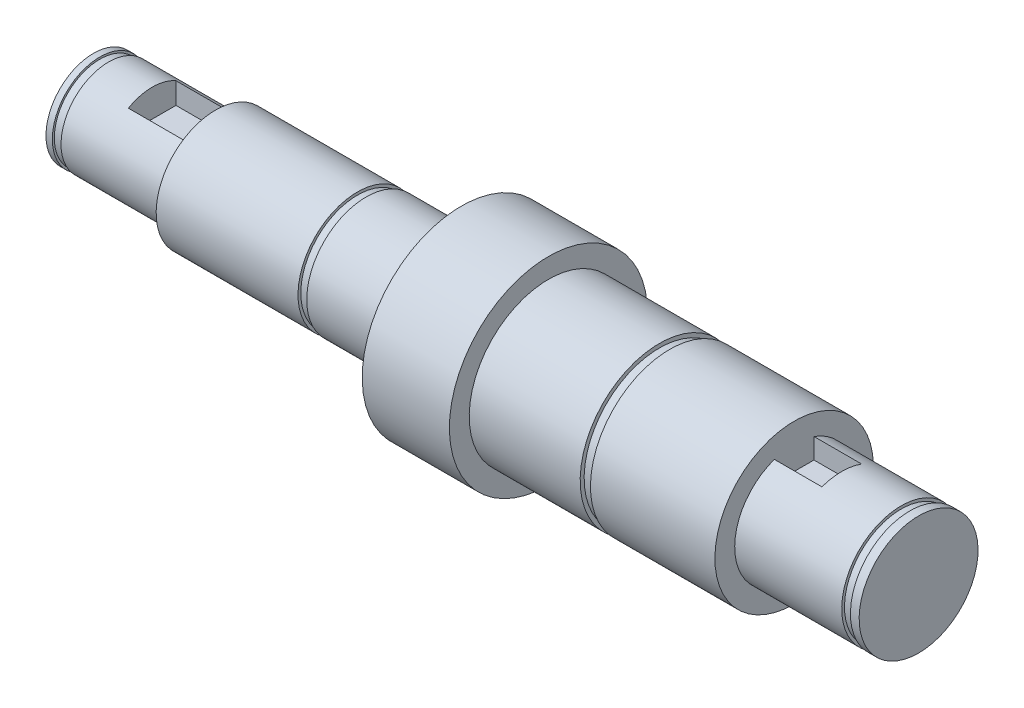
ISO-10303-21;
HEADER;
FILE_DESCRIPTION(('STEP AP214'),'2;1');
FILE_NAME('part.step','',(''),(''),'','','');
FILE_SCHEMA(('AUTOMOTIVE_DESIGN { 1 0 10303 214 1 1 1 1 }'));
ENDSEC;
DATA;
#1=APPLICATION_CONTEXT('core data for automotive mechanical design processes');
#2=APPLICATION_PROTOCOL_DEFINITION('international standard','automotive_design',2000,#1);
#3=PRODUCT_CONTEXT('',#1,'mechanical');
#4=PRODUCT('Part','Part','',(#3));
#5=PRODUCT_RELATED_PRODUCT_CATEGORY('part','',(#4));
#6=PRODUCT_DEFINITION_FORMATION('','',#4);
#7=PRODUCT_DEFINITION_CONTEXT('part definition',#1,'design');
#8=PRODUCT_DEFINITION('design','',#6,#7);
#9=PRODUCT_DEFINITION_SHAPE('','',#8);
#10=(LENGTH_UNIT() NAMED_UNIT(*) SI_UNIT(.MILLI.,.METRE.));
#11=(NAMED_UNIT(*) PLANE_ANGLE_UNIT() SI_UNIT($,.RADIAN.));
#12=(NAMED_UNIT(*) SI_UNIT($,.STERADIAN.) SOLID_ANGLE_UNIT());
#13=UNCERTAINTY_MEASURE_WITH_UNIT(LENGTH_MEASURE(1.E-05),#10,'distance_accuracy_value','');
#14=(GEOMETRIC_REPRESENTATION_CONTEXT(3) GLOBAL_UNCERTAINTY_ASSIGNED_CONTEXT((#13)) GLOBAL_UNIT_ASSIGNED_CONTEXT((#10,
#11,#12)) REPRESENTATION_CONTEXT('',''));
#15=CARTESIAN_POINT('',(0.,0.,0.));
#16=DIRECTION('',(0.,0.,1.));
#17=DIRECTION('',(1.,0.,0.));
#18=AXIS2_PLACEMENT_3D('',#15,#16,#17);
#19=CARTESIAN_POINT('',(-52.05,0.,0.));
#20=DIRECTION('',(-1.,0.,0.));
#21=DIRECTION('',(0.,-1.,0.));
#22=AXIS2_PLACEMENT_3D('',#19,#20,#21);
#23=CYLINDRICAL_SURFACE('',#22,7.49999999999998);
#24=CARTESIAN_POINT('',(49.85,0.,0.));
#25=DIRECTION('',(-1.,0.,0.));
#26=DIRECTION('',(0.,-1.,0.));
#27=AXIS2_PLACEMENT_3D('',#24,#25,#26);
#28=CIRCLE('',#27,7.49999999999998);
#29=CARTESIAN_POINT('',(49.85,-7.49999999999996,0.));
#30=VERTEX_POINT('',#29);
#31=EDGE_CURVE('E210',#30,#30,#28,.T.);
#32=ORIENTED_EDGE('',*,*,#31,.T.);
#33=EDGE_LOOP('',(#32));
#34=FACE_BOUND('',#33,.T.);
#35=DIRECTION('',(-1.,0.,0.));
#36=VECTOR('',#35,1.);
#37=CARTESIAN_POINT('',(-52.05,7.07106781186546,2.5));
#38=LINE('',#37,#36);
#39=CARTESIAN_POINT('',(36.35,7.07106781186547,2.5));
#40=VERTEX_POINT('',#39);
#41=CARTESIAN_POINT('',(42.35,7.07106781186547,2.5));
#42=VERTEX_POINT('',#41);
#43=EDGE_CURVE('E116',#40,#42,#38,.F.);
#44=ORIENTED_EDGE('',*,*,#43,.F.);
#45=CARTESIAN_POINT('',(36.35,0.,0.));
#46=DIRECTION('',(-1.,0.,0.));
#47=DIRECTION('',(0.,-1.,0.));
#48=AXIS2_PLACEMENT_3D('',#45,#46,#47);
#49=CIRCLE('',#48,7.49999999999998);
#50=CARTESIAN_POINT('',(36.35,7.07106781186547,-2.5));
#51=VERTEX_POINT('',#50);
#52=EDGE_CURVE('E207',#51,#40,#49,.T.);
#53=ORIENTED_EDGE('',*,*,#52,.F.);
#54=DIRECTION('',(-1.,0.,0.));
#55=VECTOR('',#54,1.);
#56=CARTESIAN_POINT('',(-52.05,7.07106781186546,-2.5));
#57=LINE('',#56,#55);
#58=CARTESIAN_POINT('',(42.35,7.07106781186547,-2.5));
#59=VERTEX_POINT('',#58);
#60=EDGE_CURVE('E132',#59,#51,#57,.T.);
#61=ORIENTED_EDGE('',*,*,#60,.F.);
#62=CARTESIAN_POINT('',(42.35,0.,0.));
#63=DIRECTION('',(1.,0.,0.));
#64=DIRECTION('',(0.,0.,-1.));
#65=AXIS2_PLACEMENT_3D('',#62,#63,#64);
#66=CIRCLE('',#65,7.49999999999998);
#67=EDGE_CURVE('E13',#59,#42,#66,.T.);
#68=ORIENTED_EDGE('',*,*,#67,.T.);
#69=EDGE_LOOP('',(#44,#53,#61,#68));
#70=FACE_BOUND('',#69,.T.);
#71=ADVANCED_FACE('F44',(#34,#70),#23,.T.);
#72=CARTESIAN_POINT('',(-52.05,0.,0.));
#73=DIRECTION('',(-1.,0.,0.));
#74=DIRECTION('',(0.,-1.,0.));
#75=AXIS2_PLACEMENT_3D('',#72,#73,#74);
#76=CYLINDRICAL_SURFACE('',#75,6.);
#77=CARTESIAN_POINT('',(-50.15,0.,0.));
#78=DIRECTION('',(-1.,0.,0.));
#79=DIRECTION('',(0.,-1.,0.));
#80=AXIS2_PLACEMENT_3D('',#77,#78,#79);
#81=CIRCLE('',#80,6.);
#82=CARTESIAN_POINT('',(-50.15,-6.,0.));
#83=VERTEX_POINT('',#82);
#84=EDGE_CURVE('E237',#83,#83,#81,.T.);
#85=ORIENTED_EDGE('',*,*,#84,.F.);
#86=EDGE_LOOP('',(#85));
#87=FACE_BOUND('',#86,.T.);
#88=DIRECTION('',(-1.,0.,0.));
#89=VECTOR('',#88,1.);
#90=CARTESIAN_POINT('',(-52.05,5.19615242270663,-3.));
#91=LINE('',#90,#89);
#92=CARTESIAN_POINT('',(-36.65,5.19615242270663,-3.));
#93=VERTEX_POINT('',#92);
#94=CARTESIAN_POINT('',(-44.65,5.19615242270663,-3.));
#95=VERTEX_POINT('',#94);
#96=EDGE_CURVE('E160',#93,#95,#91,.T.);
#97=ORIENTED_EDGE('',*,*,#96,.F.);
#98=CARTESIAN_POINT('',(-36.65,0.,0.));
#99=DIRECTION('',(-1.,0.,0.));
#100=DIRECTION('',(0.,-1.,0.));
#101=AXIS2_PLACEMENT_3D('',#98,#99,#100);
#102=CIRCLE('',#101,6.);
#103=CARTESIAN_POINT('',(-36.65,5.19615242270663,3.));
#104=VERTEX_POINT('',#103);
#105=EDGE_CURVE('E162',#93,#104,#102,.T.);
#106=ORIENTED_EDGE('',*,*,#105,.T.);
#107=DIRECTION('',(-1.,0.,0.));
#108=VECTOR('',#107,1.);
#109=CARTESIAN_POINT('',(-52.05,5.19615242270663,3.));
#110=LINE('',#109,#108);
#111=CARTESIAN_POINT('',(-44.65,5.19615242270663,3.));
#112=VERTEX_POINT('',#111);
#113=EDGE_CURVE('E158',#112,#104,#110,.F.);
#114=ORIENTED_EDGE('',*,*,#113,.F.);
#115=CARTESIAN_POINT('',(-44.65,0.,0.));
#116=DIRECTION('',(1.,0.,0.));
#117=DIRECTION('',(0.,0.,-1.));
#118=AXIS2_PLACEMENT_3D('',#115,#116,#117);
#119=CIRCLE('',#118,6.);
#120=EDGE_CURVE('E52',#95,#112,#119,.T.);
#121=ORIENTED_EDGE('',*,*,#120,.F.);
#122=EDGE_LOOP('',(#97,#106,#114,#121));
#123=FACE_BOUND('',#122,.T.);
#124=ADVANCED_FACE('F46',(#87,#123),#76,.T.);
#125=CARTESIAN_POINT('',(-50.15,6.,0.));
#126=DIRECTION('',(1.,0.,0.));
#127=DIRECTION('',(0.,1.,0.));
#128=AXIS2_PLACEMENT_3D('',#125,#126,#127);
#129=PLANE('',#128);
#130=CARTESIAN_POINT('',(-50.15,0.,0.));
#131=DIRECTION('',(-1.,0.,0.));
#132=DIRECTION('',(0.,-1.,0.));
#133=AXIS2_PLACEMENT_3D('',#130,#131,#132);
#134=CIRCLE('',#133,5.75);
#135=CARTESIAN_POINT('',(-50.15,-5.75,0.));
#136=VERTEX_POINT('',#135);
#137=EDGE_CURVE('E234',#136,#136,#134,.T.);
#138=ORIENTED_EDGE('',*,*,#137,.F.);
#139=EDGE_LOOP('',(#138));
#140=FACE_BOUND('',#139,.T.);
#141=ORIENTED_EDGE('',*,*,#84,.T.);
#142=EDGE_LOOP('',(#141));
#143=FACE_BOUND('',#142,.T.);
#144=ADVANCED_FACE('F271',(#140,#143),#129,.F.);
#145=CARTESIAN_POINT('',(-52.05,0.,0.));
#146=DIRECTION('',(-1.,0.,0.));
#147=DIRECTION('',(0.,-1.,0.));
#148=AXIS2_PLACEMENT_3D('',#145,#146,#147);
#149=CYLINDRICAL_SURFACE('',#148,5.75);
#150=CARTESIAN_POINT('',(-51.25,0.,0.));
#151=DIRECTION('',(-1.,0.,0.));
#152=DIRECTION('',(0.,-1.,0.));
#153=AXIS2_PLACEMENT_3D('',#150,#151,#152);
#154=CIRCLE('',#153,5.75);
#155=CARTESIAN_POINT('',(-51.25,-5.75,0.));
#156=VERTEX_POINT('',#155);
#157=EDGE_CURVE('E231',#156,#156,#154,.T.);
#158=ORIENTED_EDGE('',*,*,#157,.F.);
#159=EDGE_LOOP('',(#158));
#160=FACE_BOUND('',#159,.T.);
#161=ORIENTED_EDGE('',*,*,#137,.T.);
#162=EDGE_LOOP('',(#161));
#163=FACE_BOUND('',#162,.T.);
#164=ADVANCED_FACE('F309',(#160,#163),#149,.T.);
#165=CARTESIAN_POINT('',(-51.25,6.,0.));
#166=DIRECTION('',(-1.,0.,0.));
#167=DIRECTION('',(0.,-1.,0.));
#168=AXIS2_PLACEMENT_3D('',#165,#166,#167);
#169=PLANE('',#168);
#170=CARTESIAN_POINT('',(-51.25,0.,0.));
#171=DIRECTION('',(-1.,0.,0.));
#172=DIRECTION('',(0.,-1.,0.));
#173=AXIS2_PLACEMENT_3D('',#170,#171,#172);
#174=CIRCLE('',#173,6.);
#175=CARTESIAN_POINT('',(-51.25,-6.,0.));
#176=VERTEX_POINT('',#175);
#177=EDGE_CURVE('E228',#176,#176,#174,.T.);
#178=ORIENTED_EDGE('',*,*,#177,.F.);
#179=EDGE_LOOP('',(#178));
#180=FACE_BOUND('',#179,.T.);
#181=ORIENTED_EDGE('',*,*,#157,.T.);
#182=EDGE_LOOP('',(#181));
#183=FACE_BOUND('',#182,.T.);
#184=ADVANCED_FACE('F305',(#180,#183),#169,.F.);
#185=CARTESIAN_POINT('',(-52.05,0.,0.));
#186=DIRECTION('',(-1.,0.,0.));
#187=DIRECTION('',(0.,-1.,0.));
#188=AXIS2_PLACEMENT_3D('',#185,#186,#187);
#189=CYLINDRICAL_SURFACE('',#188,6.);
#190=CARTESIAN_POINT('',(-52.05,0.,0.));
#191=DIRECTION('',(-1.,0.,0.));
#192=DIRECTION('',(0.,-1.,0.));
#193=AXIS2_PLACEMENT_3D('',#190,#191,#192);
#194=CIRCLE('',#193,6.);
#195=CARTESIAN_POINT('',(-52.05,-6.,0.));
#196=VERTEX_POINT('',#195);
#197=EDGE_CURVE('E225',#196,#196,#194,.T.);
#198=ORIENTED_EDGE('',*,*,#197,.F.);
#199=EDGE_LOOP('',(#198));
#200=FACE_BOUND('',#199,.T.);
#201=ORIENTED_EDGE('',*,*,#177,.T.);
#202=EDGE_LOOP('',(#201));
#203=FACE_BOUND('',#202,.T.);
#204=ADVANCED_FACE('F301',(#200,#203),#189,.T.);
#205=CARTESIAN_POINT('',(-52.05,0.,0.));
#206=DIRECTION('',(1.,0.,0.));
#207=DIRECTION('',(0.,1.,0.));
#208=AXIS2_PLACEMENT_3D('',#205,#206,#207);
#209=PLANE('',#208);
#210=ORIENTED_EDGE('',*,*,#197,.T.);
#211=EDGE_LOOP('',(#210));
#212=FACE_BOUND('',#211,.T.);
#213=ADVANCED_FACE('F297',(#212),#209,.F.);
#214=CARTESIAN_POINT('',(52.05,7.5,0.));
#215=DIRECTION('',(-1.,0.,0.));
#216=DIRECTION('',(0.,-1.,0.));
#217=AXIS2_PLACEMENT_3D('',#214,#215,#216);
#218=PLANE('',#217);
#219=CARTESIAN_POINT('',(52.05,0.,0.));
#220=DIRECTION('',(-1.,0.,0.));
#221=DIRECTION('',(0.,-1.,0.));
#222=AXIS2_PLACEMENT_3D('',#219,#220,#221);
#223=CIRCLE('',#222,7.49999999999998);
#224=CARTESIAN_POINT('',(52.05,-7.49999999999996,0.));
#225=VERTEX_POINT('',#224);
#226=EDGE_CURVE('E222',#225,#225,#223,.T.);
#227=ORIENTED_EDGE('',*,*,#226,.F.);
#228=EDGE_LOOP('',(#227));
#229=FACE_BOUND('',#228,.T.);
#230=ADVANCED_FACE('F293',(#229),#218,.F.);
#231=CARTESIAN_POINT('',(-52.05,0.,0.));
#232=DIRECTION('',(-1.,0.,0.));
#233=DIRECTION('',(0.,-1.,0.));
#234=AXIS2_PLACEMENT_3D('',#231,#232,#233);
#235=CYLINDRICAL_SURFACE('',#234,7.49999999999998);
#236=CARTESIAN_POINT('',(50.95,0.,0.));
#237=DIRECTION('',(-1.,0.,0.));
#238=DIRECTION('',(0.,-1.,0.));
#239=AXIS2_PLACEMENT_3D('',#236,#237,#238);
#240=CIRCLE('',#239,7.49999999999998);
#241=CARTESIAN_POINT('',(50.95,-7.49999999999996,0.));
#242=VERTEX_POINT('',#241);
#243=EDGE_CURVE('E219',#242,#242,#240,.T.);
#244=ORIENTED_EDGE('',*,*,#243,.F.);
#245=EDGE_LOOP('',(#244));
#246=FACE_BOUND('',#245,.T.);
#247=ORIENTED_EDGE('',*,*,#226,.T.);
#248=EDGE_LOOP('',(#247));
#249=FACE_BOUND('',#248,.T.);
#250=ADVANCED_FACE('F289',(#246,#249),#235,.T.);
#251=CARTESIAN_POINT('',(50.95,7.5,0.));
#252=DIRECTION('',(1.,0.,0.));
#253=DIRECTION('',(0.,1.,0.));
#254=AXIS2_PLACEMENT_3D('',#251,#252,#253);
#255=PLANE('',#254);
#256=CARTESIAN_POINT('',(50.95,0.,0.));
#257=DIRECTION('',(-1.,0.,0.));
#258=DIRECTION('',(0.,-1.,0.));
#259=AXIS2_PLACEMENT_3D('',#256,#257,#258);
#260=CIRCLE('',#259,7.14999999999998);
#261=CARTESIAN_POINT('',(50.95,-7.14999999999996,0.));
#262=VERTEX_POINT('',#261);
#263=EDGE_CURVE('E216',#262,#262,#260,.T.);
#264=ORIENTED_EDGE('',*,*,#263,.F.);
#265=EDGE_LOOP('',(#264));
#266=FACE_BOUND('',#265,.T.);
#267=ORIENTED_EDGE('',*,*,#243,.T.);
#268=EDGE_LOOP('',(#267));
#269=FACE_BOUND('',#268,.T.);
#270=ADVANCED_FACE('F285',(#266,#269),#255,.F.);
#271=CARTESIAN_POINT('',(-52.05,0.,0.));
#272=DIRECTION('',(-1.,0.,0.));
#273=DIRECTION('',(0.,-1.,0.));
#274=AXIS2_PLACEMENT_3D('',#271,#272,#273);
#275=CYLINDRICAL_SURFACE('',#274,7.14999999999998);
#276=CARTESIAN_POINT('',(49.85,0.,0.));
#277=DIRECTION('',(-1.,0.,0.));
#278=DIRECTION('',(0.,-1.,0.));
#279=AXIS2_PLACEMENT_3D('',#276,#277,#278);
#280=CIRCLE('',#279,7.14999999999998);
#281=CARTESIAN_POINT('',(49.85,-7.14999999999996,0.));
#282=VERTEX_POINT('',#281);
#283=EDGE_CURVE('E213',#282,#282,#280,.T.);
#284=ORIENTED_EDGE('',*,*,#283,.F.);
#285=EDGE_LOOP('',(#284));
#286=FACE_BOUND('',#285,.T.);
#287=ORIENTED_EDGE('',*,*,#263,.T.);
#288=EDGE_LOOP('',(#287));
#289=FACE_BOUND('',#288,.T.);
#290=ADVANCED_FACE('F281',(#286,#289),#275,.T.);
#291=CARTESIAN_POINT('',(49.85,7.5,0.));
#292=DIRECTION('',(-1.,0.,0.));
#293=DIRECTION('',(0.,-1.,0.));
#294=AXIS2_PLACEMENT_3D('',#291,#292,#293);
#295=PLANE('',#294);
#296=ORIENTED_EDGE('',*,*,#31,.F.);
#297=EDGE_LOOP('',(#296));
#298=FACE_BOUND('',#297,.T.);
#299=ORIENTED_EDGE('',*,*,#283,.T.);
#300=EDGE_LOOP('',(#299));
#301=FACE_BOUND('',#300,.T.);
#302=ADVANCED_FACE('F278',(#298,#301),#295,.F.);
#303=CARTESIAN_POINT('',(36.35,10.,0.));
#304=DIRECTION('',(-1.,0.,0.));
#305=DIRECTION('',(0.,-1.,0.));
#306=AXIS2_PLACEMENT_3D('',#303,#304,#305);
#307=PLANE('',#306);
#308=DIRECTION('',(0.,1.,0.));
#309=VECTOR('',#308,1.);
#310=CARTESIAN_POINT('',(36.35,7.5,-2.5));
#311=LINE('',#310,#309);
#312=CARTESIAN_POINT('',(36.35,4.5,-2.5));
#313=VERTEX_POINT('',#312);
#314=EDGE_CURVE('E119',#313,#51,#311,.T.);
#315=ORIENTED_EDGE('',*,*,#314,.T.);
#316=ORIENTED_EDGE('',*,*,#52,.T.);
#317=DIRECTION('',(0.,-1.,0.));
#318=VECTOR('',#317,1.);
#319=CARTESIAN_POINT('',(36.35,7.5,2.5));
#320=LINE('',#319,#318);
#321=CARTESIAN_POINT('',(36.35,4.5,2.5));
#322=VERTEX_POINT('',#321);
#323=EDGE_CURVE('E546',#40,#322,#320,.T.);
#324=ORIENTED_EDGE('',*,*,#323,.T.);
#325=DIRECTION('',(0.,0.,-1.));
#326=VECTOR('',#325,1.);
#327=CARTESIAN_POINT('',(36.35,4.5,2.5));
#328=LINE('',#327,#326);
#329=EDGE_CURVE('E131',#322,#313,#328,.T.);
#330=ORIENTED_EDGE('',*,*,#329,.T.);
#331=EDGE_LOOP('',(#315,#316,#324,#330));
#332=FACE_BOUND('',#331,.T.);
#333=CARTESIAN_POINT('',(36.35,0.,0.));
#334=DIRECTION('',(-1.,0.,0.));
#335=DIRECTION('',(0.,-1.,0.));
#336=AXIS2_PLACEMENT_3D('',#333,#334,#335);
#337=CIRCLE('',#336,9.99999999999998);
#338=CARTESIAN_POINT('',(36.35,-9.99999999999997,0.));
#339=VERTEX_POINT('',#338);
#340=EDGE_CURVE('E204',#339,#339,#337,.T.);
#341=ORIENTED_EDGE('',*,*,#340,.F.);
#342=EDGE_LOOP('',(#341));
#343=FACE_BOUND('',#342,.T.);
#344=ADVANCED_FACE('F276',(#332,#343),#307,.F.);
#345=CARTESIAN_POINT('',(-52.05,0.,0.));
#346=DIRECTION('',(-1.,0.,0.));
#347=DIRECTION('',(0.,-1.,0.));
#348=AXIS2_PLACEMENT_3D('',#345,#346,#347);
#349=CYLINDRICAL_SURFACE('',#348,9.99999999999998);
#350=CARTESIAN_POINT('',(20.65,0.,0.));
#351=DIRECTION('',(-1.,0.,0.));
#352=DIRECTION('',(0.,-1.,0.));
#353=AXIS2_PLACEMENT_3D('',#350,#351,#352);
#354=CIRCLE('',#353,9.99999999999999);
#355=CARTESIAN_POINT('',(20.65,-9.99999999999997,0.));
#356=VERTEX_POINT('',#355);
#357=EDGE_CURVE('E201',#356,#356,#354,.T.);
#358=ORIENTED_EDGE('',*,*,#357,.F.);
#359=EDGE_LOOP('',(#358));
#360=FACE_BOUND('',#359,.T.);
#361=ORIENTED_EDGE('',*,*,#340,.T.);
#362=EDGE_LOOP('',(#361));
#363=FACE_BOUND('',#362,.T.);
#364=ADVANCED_FACE('F366',(#360,#363),#349,.T.);
#365=CARTESIAN_POINT('',(20.65,10.,0.));
#366=DIRECTION('',(1.,0.,0.));
#367=DIRECTION('',(0.,1.,0.));
#368=AXIS2_PLACEMENT_3D('',#365,#366,#367);
#369=PLANE('',#368);
#370=CARTESIAN_POINT('',(20.65,0.,0.));
#371=DIRECTION('',(-1.,0.,0.));
#372=DIRECTION('',(0.,-1.,0.));
#373=AXIS2_PLACEMENT_3D('',#370,#371,#372);
#374=CIRCLE('',#373,9.49999999999999);
#375=CARTESIAN_POINT('',(20.65,-9.49999999999997,0.));
#376=VERTEX_POINT('',#375);
#377=EDGE_CURVE('E198',#376,#376,#374,.T.);
#378=ORIENTED_EDGE('',*,*,#377,.F.);
#379=EDGE_LOOP('',(#378));
#380=FACE_BOUND('',#379,.T.);
#381=ORIENTED_EDGE('',*,*,#357,.T.);
#382=EDGE_LOOP('',(#381));
#383=FACE_BOUND('',#382,.T.);
#384=ADVANCED_FACE('F373',(#380,#383),#369,.F.);
#385=CARTESIAN_POINT('',(-52.05,0.,0.));
#386=DIRECTION('',(-1.,0.,0.));
#387=DIRECTION('',(0.,-1.,0.));
#388=AXIS2_PLACEMENT_3D('',#385,#386,#387);
#389=CYLINDRICAL_SURFACE('',#388,9.49999999999999);
#390=CARTESIAN_POINT('',(19.35,0.,0.));
#391=DIRECTION('',(-1.,0.,0.));
#392=DIRECTION('',(0.,-1.,0.));
#393=AXIS2_PLACEMENT_3D('',#390,#391,#392);
#394=CIRCLE('',#393,9.49999999999999);
#395=CARTESIAN_POINT('',(19.35,-9.49999999999997,0.));
#396=VERTEX_POINT('',#395);
#397=EDGE_CURVE('E195',#396,#396,#394,.T.);
#398=ORIENTED_EDGE('',*,*,#397,.F.);
#399=EDGE_LOOP('',(#398));
#400=FACE_BOUND('',#399,.T.);
#401=ORIENTED_EDGE('',*,*,#377,.T.);
#402=EDGE_LOOP('',(#401));
#403=FACE_BOUND('',#402,.T.);
#404=ADVANCED_FACE('F380',(#400,#403),#389,.T.);
#405=CARTESIAN_POINT('',(19.35,10.,0.));
#406=DIRECTION('',(-1.,0.,0.));
#407=DIRECTION('',(0.,-1.,0.));
#408=AXIS2_PLACEMENT_3D('',#405,#406,#407);
#409=PLANE('',#408);
#410=CARTESIAN_POINT('',(19.35,0.,0.));
#411=DIRECTION('',(-1.,0.,0.));
#412=DIRECTION('',(0.,-1.,0.));
#413=AXIS2_PLACEMENT_3D('',#410,#411,#412);
#414=CIRCLE('',#413,9.99999999999999);
#415=CARTESIAN_POINT('',(19.35,-9.99999999999997,0.));
#416=VERTEX_POINT('',#415);
#417=EDGE_CURVE('E192',#416,#416,#414,.T.);
#418=ORIENTED_EDGE('',*,*,#417,.F.);
#419=EDGE_LOOP('',(#418));
#420=FACE_BOUND('',#419,.T.);
#421=ORIENTED_EDGE('',*,*,#397,.T.);
#422=EDGE_LOOP('',(#421));
#423=FACE_BOUND('',#422,.T.);
#424=ADVANCED_FACE('F388',(#420,#423),#409,.F.);
#425=CARTESIAN_POINT('',(-52.05,0.,0.));
#426=DIRECTION('',(-1.,0.,0.));
#427=DIRECTION('',(0.,-1.,0.));
#428=AXIS2_PLACEMENT_3D('',#425,#426,#427);
#429=CYLINDRICAL_SURFACE('',#428,9.99999999999999);
#430=CARTESIAN_POINT('',(5.34999999999999,0.,0.));
#431=DIRECTION('',(-1.,0.,0.));
#432=DIRECTION('',(0.,-1.,0.));
#433=AXIS2_PLACEMENT_3D('',#430,#431,#432);
#434=CIRCLE('',#433,9.99999999999999);
#435=CARTESIAN_POINT('',(5.35,-9.99999999999998,0.));
#436=VERTEX_POINT('',#435);
#437=EDGE_CURVE('E189',#436,#436,#434,.T.);
#438=ORIENTED_EDGE('',*,*,#437,.F.);
#439=EDGE_LOOP('',(#438));
#440=FACE_BOUND('',#439,.T.);
#441=ORIENTED_EDGE('',*,*,#417,.T.);
#442=EDGE_LOOP('',(#441));
#443=FACE_BOUND('',#442,.T.);
#444=ADVANCED_FACE('F396',(#440,#443),#429,.T.);
#445=CARTESIAN_POINT('',(5.35,12.5,0.));
#446=DIRECTION('',(-1.,0.,0.));
#447=DIRECTION('',(0.,-1.,0.));
#448=AXIS2_PLACEMENT_3D('',#445,#446,#447);
#449=PLANE('',#448);
#450=CARTESIAN_POINT('',(5.34999999999999,0.,0.));
#451=DIRECTION('',(-1.,0.,0.));
#452=DIRECTION('',(0.,-1.,0.));
#453=AXIS2_PLACEMENT_3D('',#450,#451,#452);
#454=CIRCLE('',#453,12.5);
#455=CARTESIAN_POINT('',(5.35,-12.5,0.));
#456=VERTEX_POINT('',#455);
#457=EDGE_CURVE('E186',#456,#456,#454,.T.);
#458=ORIENTED_EDGE('',*,*,#457,.F.);
#459=EDGE_LOOP('',(#458));
#460=FACE_BOUND('',#459,.T.);
#461=ORIENTED_EDGE('',*,*,#437,.T.);
#462=EDGE_LOOP('',(#461));
#463=FACE_BOUND('',#462,.T.);
#464=ADVANCED_FACE('F404',(#460,#463),#449,.F.);
#465=CARTESIAN_POINT('',(-52.05,0.,0.));
#466=DIRECTION('',(-1.,0.,0.));
#467=DIRECTION('',(0.,-1.,0.));
#468=AXIS2_PLACEMENT_3D('',#465,#466,#467);
#469=CYLINDRICAL_SURFACE('',#468,12.5);
#470=CARTESIAN_POINT('',(-5.65,0.,0.));
#471=DIRECTION('',(-1.,0.,0.));
#472=DIRECTION('',(0.,-1.,0.));
#473=AXIS2_PLACEMENT_3D('',#470,#471,#472);
#474=CIRCLE('',#473,12.5);
#475=CARTESIAN_POINT('',(-5.65,-12.5,0.));
#476=VERTEX_POINT('',#475);
#477=EDGE_CURVE('E183',#476,#476,#474,.T.);
#478=ORIENTED_EDGE('',*,*,#477,.F.);
#479=EDGE_LOOP('',(#478));
#480=FACE_BOUND('',#479,.T.);
#481=ORIENTED_EDGE('',*,*,#457,.T.);
#482=EDGE_LOOP('',(#481));
#483=FACE_BOUND('',#482,.T.);
#484=ADVANCED_FACE('F412',(#480,#483),#469,.T.);
#485=CARTESIAN_POINT('',(-5.65,7.5,0.));
#486=DIRECTION('',(1.,0.,0.));
#487=DIRECTION('',(0.,1.,0.));
#488=AXIS2_PLACEMENT_3D('',#485,#486,#487);
#489=PLANE('',#488);
#490=CARTESIAN_POINT('',(-5.65,0.,0.));
#491=DIRECTION('',(-1.,0.,0.));
#492=DIRECTION('',(0.,-1.,0.));
#493=AXIS2_PLACEMENT_3D('',#490,#491,#492);
#494=CIRCLE('',#493,7.49999999999999);
#495=CARTESIAN_POINT('',(-5.65,-7.49999999999998,0.));
#496=VERTEX_POINT('',#495);
#497=EDGE_CURVE('E180',#496,#496,#494,.T.);
#498=ORIENTED_EDGE('',*,*,#497,.F.);
#499=EDGE_LOOP('',(#498));
#500=FACE_BOUND('',#499,.T.);
#501=ORIENTED_EDGE('',*,*,#477,.T.);
#502=EDGE_LOOP('',(#501));
#503=FACE_BOUND('',#502,.T.);
#504=ADVANCED_FACE('F420',(#500,#503),#489,.F.);
#505=CARTESIAN_POINT('',(-52.05,0.,0.));
#506=DIRECTION('',(-1.,0.,0.));
#507=DIRECTION('',(0.,-1.,0.));
#508=AXIS2_PLACEMENT_3D('',#505,#506,#507);
#509=CYLINDRICAL_SURFACE('',#508,7.49999999999999);
#510=CARTESIAN_POINT('',(-17.65,0.,0.));
#511=DIRECTION('',(-1.,0.,0.));
#512=DIRECTION('',(0.,-1.,0.));
#513=AXIS2_PLACEMENT_3D('',#510,#511,#512);
#514=CIRCLE('',#513,7.49999999999999);
#515=CARTESIAN_POINT('',(-17.65,-7.49999999999999,0.));
#516=VERTEX_POINT('',#515);
#517=EDGE_CURVE('E177',#516,#516,#514,.T.);
#518=ORIENTED_EDGE('',*,*,#517,.F.);
#519=EDGE_LOOP('',(#518));
#520=FACE_BOUND('',#519,.T.);
#521=ORIENTED_EDGE('',*,*,#497,.T.);
#522=EDGE_LOOP('',(#521));
#523=FACE_BOUND('',#522,.T.);
#524=ADVANCED_FACE('F428',(#520,#523),#509,.T.);
#525=CARTESIAN_POINT('',(-17.65,7.5,0.));
#526=DIRECTION('',(1.,0.,0.));
#527=DIRECTION('',(0.,1.,0.));
#528=AXIS2_PLACEMENT_3D('',#525,#526,#527);
#529=PLANE('',#528);
#530=CARTESIAN_POINT('',(-17.65,0.,0.));
#531=DIRECTION('',(-1.,0.,0.));
#532=DIRECTION('',(0.,-1.,0.));
#533=AXIS2_PLACEMENT_3D('',#530,#531,#532);
#534=CIRCLE('',#533,7.14999999999999);
#535=CARTESIAN_POINT('',(-17.65,-7.14999999999999,0.));
#536=VERTEX_POINT('',#535);
#537=EDGE_CURVE('E174',#536,#536,#534,.T.);
#538=ORIENTED_EDGE('',*,*,#537,.F.);
#539=EDGE_LOOP('',(#538));
#540=FACE_BOUND('',#539,.T.);
#541=ORIENTED_EDGE('',*,*,#517,.T.);
#542=EDGE_LOOP('',(#541));
#543=FACE_BOUND('',#542,.T.);
#544=ADVANCED_FACE('F436',(#540,#543),#529,.F.);
#545=CARTESIAN_POINT('',(-52.05,0.,0.));
#546=DIRECTION('',(-1.,0.,0.));
#547=DIRECTION('',(0.,-1.,0.));
#548=AXIS2_PLACEMENT_3D('',#545,#546,#547);
#549=CYLINDRICAL_SURFACE('',#548,7.14999999999999);
#550=CARTESIAN_POINT('',(-18.75,0.,0.));
#551=DIRECTION('',(-1.,0.,0.));
#552=DIRECTION('',(0.,-1.,0.));
#553=AXIS2_PLACEMENT_3D('',#550,#551,#552);
#554=CIRCLE('',#553,7.14999999999999);
#555=CARTESIAN_POINT('',(-18.75,-7.14999999999999,0.));
#556=VERTEX_POINT('',#555);
#557=EDGE_CURVE('E171',#556,#556,#554,.T.);
#558=ORIENTED_EDGE('',*,*,#557,.F.);
#559=EDGE_LOOP('',(#558));
#560=FACE_BOUND('',#559,.T.);
#561=ORIENTED_EDGE('',*,*,#537,.T.);
#562=EDGE_LOOP('',(#561));
#563=FACE_BOUND('',#562,.T.);
#564=ADVANCED_FACE('F444',(#560,#563),#549,.T.);
#565=CARTESIAN_POINT('',(-18.75,7.5,0.));
#566=DIRECTION('',(-1.,0.,0.));
#567=DIRECTION('',(0.,-1.,0.));
#568=AXIS2_PLACEMENT_3D('',#565,#566,#567);
#569=PLANE('',#568);
#570=CARTESIAN_POINT('',(-18.75,0.,0.));
#571=DIRECTION('',(-1.,0.,0.));
#572=DIRECTION('',(0.,-1.,0.));
#573=AXIS2_PLACEMENT_3D('',#570,#571,#572);
#574=CIRCLE('',#573,7.49999999999999);
#575=CARTESIAN_POINT('',(-18.75,-7.49999999999999,0.));
#576=VERTEX_POINT('',#575);
#577=EDGE_CURVE('E168',#576,#576,#574,.T.);
#578=ORIENTED_EDGE('',*,*,#577,.F.);
#579=EDGE_LOOP('',(#578));
#580=FACE_BOUND('',#579,.T.);
#581=ORIENTED_EDGE('',*,*,#557,.T.);
#582=EDGE_LOOP('',(#581));
#583=FACE_BOUND('',#582,.T.);
#584=ADVANCED_FACE('F452',(#580,#583),#569,.F.);
#585=CARTESIAN_POINT('',(-52.05,0.,0.));
#586=DIRECTION('',(-1.,0.,0.));
#587=DIRECTION('',(0.,-1.,0.));
#588=AXIS2_PLACEMENT_3D('',#585,#586,#587);
#589=CYLINDRICAL_SURFACE('',#588,7.5);
#590=CARTESIAN_POINT('',(-36.65,0.,0.));
#591=DIRECTION('',(-1.,0.,0.));
#592=DIRECTION('',(0.,-1.,0.));
#593=AXIS2_PLACEMENT_3D('',#590,#591,#592);
#594=CIRCLE('',#593,7.5);
#595=CARTESIAN_POINT('',(-36.65,-7.49999999999999,0.));
#596=VERTEX_POINT('',#595);
#597=EDGE_CURVE('E165',#596,#596,#594,.T.);
#598=ORIENTED_EDGE('',*,*,#597,.F.);
#599=EDGE_LOOP('',(#598));
#600=FACE_BOUND('',#599,.T.);
#601=ORIENTED_EDGE('',*,*,#577,.T.);
#602=EDGE_LOOP('',(#601));
#603=FACE_BOUND('',#602,.T.);
#604=ADVANCED_FACE('F460',(#600,#603),#589,.T.);
#605=CARTESIAN_POINT('',(-36.65,6.,0.));
#606=DIRECTION('',(1.,0.,0.));
#607=DIRECTION('',(0.,1.,0.));
#608=AXIS2_PLACEMENT_3D('',#605,#606,#607);
#609=PLANE('',#608);
#610=ORIENTED_EDGE('',*,*,#105,.F.);
#611=DIRECTION('',(0.,-1.,0.));
#612=VECTOR('',#611,1.);
#613=CARTESIAN_POINT('',(-36.65,2.5,-3.));
#614=LINE('',#613,#612);
#615=CARTESIAN_POINT('',(-36.65,2.5,-3.));
#616=VERTEX_POINT('',#615);
#617=EDGE_CURVE('E140',#93,#616,#614,.T.);
#618=ORIENTED_EDGE('',*,*,#617,.T.);
#619=DIRECTION('',(0.,0.,1.));
#620=VECTOR('',#619,1.);
#621=CARTESIAN_POINT('',(-36.65,2.5,-3.));
#622=LINE('',#621,#620);
#623=CARTESIAN_POINT('',(-36.65,2.5,3.));
#624=VERTEX_POINT('',#623);
#625=EDGE_CURVE('E150',#616,#624,#622,.T.);
#626=ORIENTED_EDGE('',*,*,#625,.T.);
#627=DIRECTION('',(0.,1.,0.));
#628=VECTOR('',#627,1.);
#629=CARTESIAN_POINT('',(-36.65,2.5,3.));
#630=LINE('',#629,#628);
#631=EDGE_CURVE('E59',#624,#104,#630,.T.);
#632=ORIENTED_EDGE('',*,*,#631,.T.);
#633=EDGE_LOOP('',(#610,#618,#626,#632));
#634=FACE_BOUND('',#633,.T.);
#635=ORIENTED_EDGE('',*,*,#597,.T.);
#636=EDGE_LOOP('',(#635));
#637=FACE_BOUND('',#636,.T.);
#638=ADVANCED_FACE('F247',(#634,#637),#609,.F.);
#639=CARTESIAN_POINT('',(-44.65,0.,0.));
#640=DIRECTION('',(1.,0.,0.));
#641=DIRECTION('',(0.,0.,-1.));
#642=AXIS2_PLACEMENT_3D('',#639,#640,#641);
#643=PLANE('',#642);
#644=DIRECTION('',(0.,-1.,0.));
#645=VECTOR('',#644,1.);
#646=CARTESIAN_POINT('',(-44.65,2.5,-3.));
#647=LINE('',#646,#645);
#648=CARTESIAN_POINT('',(-44.65,2.5,-3.));
#649=VERTEX_POINT('',#648);
#650=EDGE_CURVE('E141',#95,#649,#647,.T.);
#651=ORIENTED_EDGE('',*,*,#650,.F.);
#652=ORIENTED_EDGE('',*,*,#120,.T.);
#653=DIRECTION('',(0.,1.,0.));
#654=VECTOR('',#653,1.);
#655=CARTESIAN_POINT('',(-44.65,2.5,3.));
#656=LINE('',#655,#654);
#657=CARTESIAN_POINT('',(-44.65,2.5,3.));
#658=VERTEX_POINT('',#657);
#659=EDGE_CURVE('E145',#658,#112,#656,.T.);
#660=ORIENTED_EDGE('',*,*,#659,.F.);
#661=DIRECTION('',(0.,0.,1.));
#662=VECTOR('',#661,1.);
#663=CARTESIAN_POINT('',(-44.65,2.5,-3.));
#664=LINE('',#663,#662);
#665=EDGE_CURVE('E143',#649,#658,#664,.T.);
#666=ORIENTED_EDGE('',*,*,#665,.F.);
#667=EDGE_LOOP('',(#651,#652,#660,#666));
#668=FACE_BOUND('',#667,.T.);
#669=ADVANCED_FACE('F242',(#668),#643,.T.);
#670=CARTESIAN_POINT('',(-44.65,2.5,-3.));
#671=DIRECTION('',(0.,0.,1.));
#672=DIRECTION('',(1.,0.,0.));
#673=AXIS2_PLACEMENT_3D('',#670,#671,#672);
#674=PLANE('',#673);
#675=ORIENTED_EDGE('',*,*,#96,.T.);
#676=ORIENTED_EDGE('',*,*,#650,.T.);
#677=DIRECTION('',(1.,0.,0.));
#678=VECTOR('',#677,1.);
#679=CARTESIAN_POINT('',(-44.65,2.5,-3.));
#680=LINE('',#679,#678);
#681=EDGE_CURVE('E155',#649,#616,#680,.T.);
#682=ORIENTED_EDGE('',*,*,#681,.T.);
#683=ORIENTED_EDGE('',*,*,#617,.F.);
#684=EDGE_LOOP('',(#675,#676,#682,#683));
#685=FACE_BOUND('',#684,.T.);
#686=ADVANCED_FACE('F254',(#685),#674,.T.);
#687=CARTESIAN_POINT('',(-44.65,2.5,3.));
#688=DIRECTION('',(0.,0.,-1.));
#689=DIRECTION('',(-1.,0.,0.));
#690=AXIS2_PLACEMENT_3D('',#687,#688,#689);
#691=PLANE('',#690);
#692=ORIENTED_EDGE('',*,*,#113,.T.);
#693=ORIENTED_EDGE('',*,*,#631,.F.);
#694=DIRECTION('',(1.,0.,0.));
#695=VECTOR('',#694,1.);
#696=CARTESIAN_POINT('',(-44.65,2.5,3.));
#697=LINE('',#696,#695);
#698=EDGE_CURVE('E148',#658,#624,#697,.T.);
#699=ORIENTED_EDGE('',*,*,#698,.F.);
#700=ORIENTED_EDGE('',*,*,#659,.T.);
#701=EDGE_LOOP('',(#692,#693,#699,#700));
#702=FACE_BOUND('',#701,.T.);
#703=ADVANCED_FACE('F246',(#702),#691,.T.);
#704=CARTESIAN_POINT('',(-44.65,2.5,-3.));
#705=DIRECTION('',(0.,1.,0.));
#706=DIRECTION('',(-1.,0.,0.));
#707=AXIS2_PLACEMENT_3D('',#704,#705,#706);
#708=PLANE('',#707);
#709=ORIENTED_EDGE('',*,*,#625,.F.);
#710=ORIENTED_EDGE('',*,*,#681,.F.);
#711=ORIENTED_EDGE('',*,*,#665,.T.);
#712=ORIENTED_EDGE('',*,*,#698,.T.);
#713=EDGE_LOOP('',(#709,#710,#711,#712));
#714=FACE_BOUND('',#713,.T.);
#715=ADVANCED_FACE('F253',(#714),#708,.T.);
#716=CARTESIAN_POINT('',(42.35,0.,0.));
#717=DIRECTION('',(1.,0.,0.));
#718=DIRECTION('',(0.,0.,-1.));
#719=AXIS2_PLACEMENT_3D('',#716,#717,#718);
#720=PLANE('',#719);
#721=DIRECTION('',(0.,1.,0.));
#722=VECTOR('',#721,1.);
#723=CARTESIAN_POINT('',(42.35,7.5,-2.5));
#724=LINE('',#723,#722);
#725=CARTESIAN_POINT('',(42.35,4.5,-2.5));
#726=VERTEX_POINT('',#725);
#727=EDGE_CURVE('E124',#726,#59,#724,.T.);
#728=ORIENTED_EDGE('',*,*,#727,.F.);
#729=DIRECTION('',(0.,0.,-1.));
#730=VECTOR('',#729,1.);
#731=CARTESIAN_POINT('',(42.35,4.5,2.5));
#732=LINE('',#731,#730);
#733=CARTESIAN_POINT('',(42.35,4.5,2.5));
#734=VERTEX_POINT('',#733);
#735=EDGE_CURVE('E118',#734,#726,#732,.T.);
#736=ORIENTED_EDGE('',*,*,#735,.F.);
#737=DIRECTION('',(0.,-1.,0.));
#738=VECTOR('',#737,1.);
#739=CARTESIAN_POINT('',(42.35,7.5,2.5));
#740=LINE('',#739,#738);
#741=EDGE_CURVE('E110',#42,#734,#740,.T.);
#742=ORIENTED_EDGE('',*,*,#741,.F.);
#743=ORIENTED_EDGE('',*,*,#67,.F.);
#744=EDGE_LOOP('',(#728,#736,#742,#743));
#745=FACE_BOUND('',#744,.T.);
#746=ADVANCED_FACE('F122',(#745),#720,.F.);
#747=CARTESIAN_POINT('',(42.35,7.5,2.5));
#748=DIRECTION('',(0.,0.,-1.));
#749=DIRECTION('',(-1.,0.,0.));
#750=AXIS2_PLACEMENT_3D('',#747,#748,#749);
#751=PLANE('',#750);
#752=ORIENTED_EDGE('',*,*,#43,.T.);
#753=ORIENTED_EDGE('',*,*,#741,.T.);
#754=DIRECTION('',(-1.,0.,0.));
#755=VECTOR('',#754,1.);
#756=CARTESIAN_POINT('',(42.35,4.5,2.5));
#757=LINE('',#756,#755);
#758=EDGE_CURVE('E114',#734,#322,#757,.T.);
#759=ORIENTED_EDGE('',*,*,#758,.T.);
#760=ORIENTED_EDGE('',*,*,#323,.F.);
#761=EDGE_LOOP('',(#752,#753,#759,#760));
#762=FACE_BOUND('',#761,.T.);
#763=ADVANCED_FACE('F112',(#762),#751,.T.);
#764=CARTESIAN_POINT('',(42.35,7.5,-2.5));
#765=DIRECTION('',(0.,0.,1.));
#766=DIRECTION('',(0.,-1.,0.));
#767=AXIS2_PLACEMENT_3D('',#764,#765,#766);
#768=PLANE('',#767);
#769=ORIENTED_EDGE('',*,*,#60,.T.);
#770=ORIENTED_EDGE('',*,*,#314,.F.);
#771=DIRECTION('',(-1.,0.,0.));
#772=VECTOR('',#771,1.);
#773=CARTESIAN_POINT('',(42.35,4.5,-2.5));
#774=LINE('',#773,#772);
#775=EDGE_CURVE('E133',#726,#313,#774,.T.);
#776=ORIENTED_EDGE('',*,*,#775,.F.);
#777=ORIENTED_EDGE('',*,*,#727,.T.);
#778=EDGE_LOOP('',(#769,#770,#776,#777));
#779=FACE_BOUND('',#778,.T.);
#780=ADVANCED_FACE('F520',(#779),#768,.T.);
#781=CARTESIAN_POINT('',(42.35,4.5,2.5));
#782=DIRECTION('',(0.,1.,0.));
#783=DIRECTION('',(-1.,0.,0.));
#784=AXIS2_PLACEMENT_3D('',#781,#782,#783);
#785=PLANE('',#784);
#786=ORIENTED_EDGE('',*,*,#329,.F.);
#787=ORIENTED_EDGE('',*,*,#758,.F.);
#788=ORIENTED_EDGE('',*,*,#735,.T.);
#789=ORIENTED_EDGE('',*,*,#775,.T.);
#790=EDGE_LOOP('',(#786,#787,#788,#789));
#791=FACE_BOUND('',#790,.T.);
#792=ADVANCED_FACE('F130',(#791),#785,.T.);
#793=CLOSED_SHELL('',(#71,#124,#144,#164,#184,#204,#213,#230,#250,#270,#290,#302,#344,#364,#384,
#404,#424,#444,#464,#484,#504,#524,#544,#564,#584,#604,#638,#669,#686,#703,#715,#746,#763,#780,#792));
#794=MANIFOLD_SOLID_BREP('B2',#793);
#795=ADVANCED_BREP_SHAPE_REPRESENTATION('',(#18,#794),#14);
#796=SHAPE_DEFINITION_REPRESENTATION(#9,#795);
ENDSEC;
END-ISO-10303-21;
